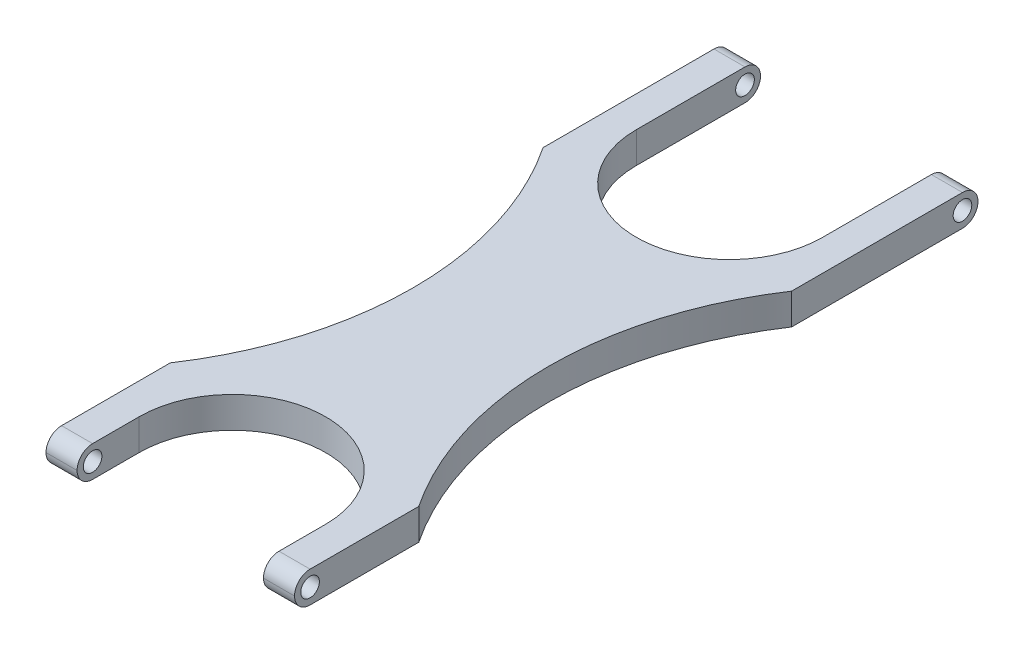
ISO-10303-21;
HEADER;
FILE_DESCRIPTION(('STEP AP214'),'2;1');
FILE_NAME('part.step','',(''),(''),'','','');
FILE_SCHEMA(('AUTOMOTIVE_DESIGN { 1 0 10303 214 1 1 1 1 }'));
ENDSEC;
DATA;
#1=APPLICATION_CONTEXT('core data for automotive mechanical design processes');
#2=APPLICATION_PROTOCOL_DEFINITION('international standard','automotive_design',2000,#1);
#3=PRODUCT_CONTEXT('',#1,'mechanical');
#4=PRODUCT('Part','Part','',(#3));
#5=PRODUCT_RELATED_PRODUCT_CATEGORY('part','',(#4));
#6=PRODUCT_DEFINITION_FORMATION('','',#4);
#7=PRODUCT_DEFINITION_CONTEXT('part definition',#1,'design');
#8=PRODUCT_DEFINITION('design','',#6,#7);
#9=PRODUCT_DEFINITION_SHAPE('','',#8);
#10=(LENGTH_UNIT() NAMED_UNIT(*) SI_UNIT(.MILLI.,.METRE.));
#11=(NAMED_UNIT(*) PLANE_ANGLE_UNIT() SI_UNIT($,.RADIAN.));
#12=(NAMED_UNIT(*) SI_UNIT($,.STERADIAN.) SOLID_ANGLE_UNIT());
#13=UNCERTAINTY_MEASURE_WITH_UNIT(LENGTH_MEASURE(1.E-05),#10,'distance_accuracy_value','');
#14=(GEOMETRIC_REPRESENTATION_CONTEXT(3) GLOBAL_UNCERTAINTY_ASSIGNED_CONTEXT((#13)) GLOBAL_UNIT_ASSIGNED_CONTEXT((#10,
#11,#12)) REPRESENTATION_CONTEXT('',''));
#15=CARTESIAN_POINT('',(0.,0.,0.));
#16=DIRECTION('',(0.,0.,1.));
#17=DIRECTION('',(1.,0.,0.));
#18=AXIS2_PLACEMENT_3D('',#15,#16,#17);
#19=CARTESIAN_POINT('',(0.,12.7,0.));
#20=DIRECTION('',(1.,0.,0.));
#21=DIRECTION('',(0.,0.,-1.));
#22=AXIS2_PLACEMENT_3D('',#19,#20,#21);
#23=PLANE('',#22);
#24=CARTESIAN_POINT('',(-1.11022302462516E-13,6.35,6.35000000000002));
#25=DIRECTION('',(1.,0.,0.));
#26=DIRECTION('',(0.,0.,-1.));
#27=AXIS2_PLACEMENT_3D('',#24,#25,#26);
#28=CIRCLE('',#27,3.81);
#29=CARTESIAN_POINT('',(-1.12410081243297E-13,6.35,2.54000000000002));
#30=VERTEX_POINT('',#29);
#31=EDGE_CURVE('E643',#30,#30,#28,.T.);
#32=ORIENTED_EDGE('',*,*,#31,.T.);
#33=EDGE_LOOP('',(#32));
#34=FACE_BOUND('',#33,.T.);
#35=CARTESIAN_POINT('',(0.,6.35,6.34999999999999));
#36=DIRECTION('',(1.,0.,0.));
#37=DIRECTION('',(0.,0.,-1.));
#38=AXIS2_PLACEMENT_3D('',#35,#36,#37);
#39=CIRCLE('',#38,6.35);
#40=CARTESIAN_POINT('',(0.,12.7,6.34999999999999));
#41=VERTEX_POINT('',#40);
#42=CARTESIAN_POINT('',(0.,6.35,0.));
#43=VERTEX_POINT('',#42);
#44=EDGE_CURVE('E221',#41,#43,#39,.F.);
#45=ORIENTED_EDGE('',*,*,#44,.T.);
#46=CARTESIAN_POINT('',(0.,6.35,6.35));
#47=DIRECTION('',(1.,0.,0.));
#48=DIRECTION('',(0.,0.,-1.));
#49=AXIS2_PLACEMENT_3D('',#46,#47,#48);
#50=CIRCLE('',#49,6.35);
#51=CARTESIAN_POINT('',(0.,0.,6.35));
#52=VERTEX_POINT('',#51);
#53=EDGE_CURVE('E223',#43,#52,#50,.F.);
#54=ORIENTED_EDGE('',*,*,#53,.T.);
#55=DIRECTION('',(0.,0.,1.));
#56=VECTOR('',#55,1.);
#57=CARTESIAN_POINT('',(0.,0.,0.));
#58=LINE('',#57,#56);
#59=CARTESIAN_POINT('',(0.,0.,76.2));
#60=VERTEX_POINT('',#59);
#61=EDGE_CURVE('E194',#52,#60,#58,.T.);
#62=ORIENTED_EDGE('',*,*,#61,.T.);
#63=DIRECTION('',(0.,-1.,0.));
#64=VECTOR('',#63,1.);
#65=CARTESIAN_POINT('',(0.,12.7,76.2));
#66=LINE('',#65,#64);
#67=CARTESIAN_POINT('',(0.,12.7,76.2));
#68=VERTEX_POINT('',#67);
#69=EDGE_CURVE('E187',#68,#60,#66,.T.);
#70=ORIENTED_EDGE('',*,*,#69,.F.);
#71=DIRECTION('',(0.,0.,1.));
#72=VECTOR('',#71,1.);
#73=CARTESIAN_POINT('',(0.,12.7,0.));
#74=LINE('',#73,#72);
#75=EDGE_CURVE('E169',#41,#68,#74,.T.);
#76=ORIENTED_EDGE('',*,*,#75,.F.);
#77=EDGE_LOOP('',(#45,#54,#62,#70,#76));
#78=FACE_BOUND('',#77,.T.);
#79=ADVANCED_FACE('F32',(#34,#78),#23,.F.);
#80=CARTESIAN_POINT('',(-114.3,12.7,152.4));
#81=DIRECTION('',(0.,-1.,0.));
#82=DIRECTION('',(0.,0.,-1.));
#83=AXIS2_PLACEMENT_3D('',#80,#81,#82);
#84=CYLINDRICAL_SURFACE('',#83,137.371503595178);
#85=CARTESIAN_POINT('',(-114.3,0.,152.4));
#86=DIRECTION('',(0.,-1.,0.));
#87=DIRECTION('',(0.,0.,-1.));
#88=AXIS2_PLACEMENT_3D('',#85,#86,#87);
#89=CIRCLE('',#88,137.371503595178);
#90=CARTESIAN_POINT('',(0.,0.,228.6));
#91=VERTEX_POINT('',#90);
#92=EDGE_CURVE('E293',#60,#91,#89,.T.);
#93=ORIENTED_EDGE('',*,*,#92,.T.);
#94=DIRECTION('',(0.,-1.,0.));
#95=VECTOR('',#94,1.);
#96=CARTESIAN_POINT('',(0.,12.7,228.6));
#97=LINE('',#96,#95);
#98=CARTESIAN_POINT('',(0.,12.7,228.6));
#99=VERTEX_POINT('',#98);
#100=EDGE_CURVE('E189',#99,#91,#97,.T.);
#101=ORIENTED_EDGE('',*,*,#100,.F.);
#102=CARTESIAN_POINT('',(-114.3,12.7,152.4));
#103=DIRECTION('',(0.,-1.,0.));
#104=DIRECTION('',(0.,0.,-1.));
#105=AXIS2_PLACEMENT_3D('',#102,#103,#104);
#106=CIRCLE('',#105,137.371503595178);
#107=EDGE_CURVE('E174',#68,#99,#106,.T.);
#108=ORIENTED_EDGE('',*,*,#107,.F.);
#109=ORIENTED_EDGE('',*,*,#69,.T.);
#110=EDGE_LOOP('',(#93,#101,#108,#109));
#111=FACE_BOUND('',#110,.T.);
#112=ADVANCED_FACE('F186',(#111),#84,.F.);
#113=CARTESIAN_POINT('',(0.,12.7,228.6));
#114=DIRECTION('',(1.,0.,0.));
#115=DIRECTION('',(0.,0.,-1.));
#116=AXIS2_PLACEMENT_3D('',#113,#114,#115);
#117=PLANE('',#116);
#118=CARTESIAN_POINT('',(0.,6.35,273.05));
#119=DIRECTION('',(1.,0.,0.));
#120=DIRECTION('',(0.,0.,-1.));
#121=AXIS2_PLACEMENT_3D('',#118,#119,#120);
#122=CIRCLE('',#121,3.81000000000004);
#123=CARTESIAN_POINT('',(0.,6.35,269.24));
#124=VERTEX_POINT('',#123);
#125=EDGE_CURVE('E267',#124,#124,#122,.T.);
#126=ORIENTED_EDGE('',*,*,#125,.T.);
#127=EDGE_LOOP('',(#126));
#128=FACE_BOUND('',#127,.T.);
#129=DIRECTION('',(0.,0.,1.));
#130=VECTOR('',#129,1.);
#131=CARTESIAN_POINT('',(0.,0.,228.6));
#132=LINE('',#131,#130);
#133=CARTESIAN_POINT('',(0.,0.,273.05));
#134=VERTEX_POINT('',#133);
#135=EDGE_CURVE('E295',#91,#134,#132,.T.);
#136=ORIENTED_EDGE('',*,*,#135,.T.);
#137=CARTESIAN_POINT('',(0.,6.35,273.05));
#138=DIRECTION('',(1.,0.,0.));
#139=DIRECTION('',(0.,0.,-1.));
#140=AXIS2_PLACEMENT_3D('',#137,#138,#139);
#141=CIRCLE('',#140,6.35);
#142=CARTESIAN_POINT('',(0.,6.35,279.4));
#143=VERTEX_POINT('',#142);
#144=EDGE_CURVE('E242',#134,#143,#141,.F.);
#145=ORIENTED_EDGE('',*,*,#144,.T.);
#146=CARTESIAN_POINT('',(0.,6.35,273.05));
#147=DIRECTION('',(1.,0.,0.));
#148=DIRECTION('',(0.,0.,-1.));
#149=AXIS2_PLACEMENT_3D('',#146,#147,#148);
#150=CIRCLE('',#149,6.35);
#151=CARTESIAN_POINT('',(0.,12.7,273.05));
#152=VERTEX_POINT('',#151);
#153=EDGE_CURVE('E240',#143,#152,#150,.F.);
#154=ORIENTED_EDGE('',*,*,#153,.T.);
#155=DIRECTION('',(0.,0.,1.));
#156=VECTOR('',#155,1.);
#157=CARTESIAN_POINT('',(0.,12.7,228.6));
#158=LINE('',#157,#156);
#159=EDGE_CURVE('E191',#99,#152,#158,.T.);
#160=ORIENTED_EDGE('',*,*,#159,.F.);
#161=ORIENTED_EDGE('',*,*,#100,.T.);
#162=EDGE_LOOP('',(#136,#145,#154,#160,#161));
#163=FACE_BOUND('',#162,.T.);
#164=ADVANCED_FACE('F396',(#128,#163),#117,.F.);
#165=CARTESIAN_POINT('',(12.7,12.7,279.4));
#166=DIRECTION('',(-1.,0.,0.));
#167=DIRECTION('',(0.,0.,1.));
#168=AXIS2_PLACEMENT_3D('',#165,#166,#167);
#169=PLANE('',#168);
#170=CARTESIAN_POINT('',(12.7,6.35,273.05));
#171=DIRECTION('',(-1.,0.,0.));
#172=DIRECTION('',(0.,0.,1.));
#173=AXIS2_PLACEMENT_3D('',#170,#171,#172);
#174=CIRCLE('',#173,3.81000000000004);
#175=CARTESIAN_POINT('',(12.7,6.35,276.86));
#176=VERTEX_POINT('',#175);
#177=EDGE_CURVE('E258',#176,#176,#174,.T.);
#178=ORIENTED_EDGE('',*,*,#177,.T.);
#179=EDGE_LOOP('',(#178));
#180=FACE_BOUND('',#179,.T.);
#181=CARTESIAN_POINT('',(12.7,6.35,273.05));
#182=DIRECTION('',(-1.,0.,0.));
#183=DIRECTION('',(0.,0.,1.));
#184=AXIS2_PLACEMENT_3D('',#181,#182,#183);
#185=CIRCLE('',#184,6.35);
#186=CARTESIAN_POINT('',(12.7,12.7,273.05));
#187=VERTEX_POINT('',#186);
#188=CARTESIAN_POINT('',(12.7,6.35,279.4));
#189=VERTEX_POINT('',#188);
#190=EDGE_CURVE('E236',#187,#189,#185,.F.);
#191=ORIENTED_EDGE('',*,*,#190,.T.);
#192=CARTESIAN_POINT('',(12.7,6.35,273.05));
#193=DIRECTION('',(-1.,0.,0.));
#194=DIRECTION('',(0.,0.,1.));
#195=AXIS2_PLACEMENT_3D('',#192,#193,#194);
#196=CIRCLE('',#195,6.35);
#197=CARTESIAN_POINT('',(12.7,0.,273.05));
#198=VERTEX_POINT('',#197);
#199=EDGE_CURVE('E238',#189,#198,#196,.F.);
#200=ORIENTED_EDGE('',*,*,#199,.T.);
#201=DIRECTION('',(0.,0.,-1.));
#202=VECTOR('',#201,1.);
#203=CARTESIAN_POINT('',(12.7,0.,279.4));
#204=LINE('',#203,#202);
#205=CARTESIAN_POINT('',(12.7,0.,254.));
#206=VERTEX_POINT('',#205);
#207=EDGE_CURVE('E298',#198,#206,#204,.T.);
#208=ORIENTED_EDGE('',*,*,#207,.T.);
#209=DIRECTION('',(0.,-1.,0.));
#210=VECTOR('',#209,1.);
#211=CARTESIAN_POINT('',(12.7,12.7,254.));
#212=LINE('',#211,#210);
#213=CARTESIAN_POINT('',(12.7,12.7,254.));
#214=VERTEX_POINT('',#213);
#215=EDGE_CURVE('E200',#214,#206,#212,.T.);
#216=ORIENTED_EDGE('',*,*,#215,.F.);
#217=DIRECTION('',(0.,0.,-1.));
#218=VECTOR('',#217,1.);
#219=CARTESIAN_POINT('',(12.7,12.7,279.4));
#220=LINE('',#219,#218);
#221=EDGE_CURVE('E272',#187,#214,#220,.T.);
#222=ORIENTED_EDGE('',*,*,#221,.F.);
#223=EDGE_LOOP('',(#191,#200,#208,#216,#222));
#224=FACE_BOUND('',#223,.T.);
#225=ADVANCED_FACE('F339',(#180,#224),#169,.F.);
#226=CARTESIAN_POINT('',(50.8,12.7,254.));
#227=DIRECTION('',(0.,-1.,0.));
#228=DIRECTION('',(0.,0.,-1.));
#229=AXIS2_PLACEMENT_3D('',#226,#227,#228);
#230=CYLINDRICAL_SURFACE('',#229,38.1);
#231=CARTESIAN_POINT('',(50.8,0.,254.));
#232=DIRECTION('',(0.,-1.,0.));
#233=DIRECTION('',(0.,0.,1.));
#234=AXIS2_PLACEMENT_3D('',#231,#232,#233);
#235=CIRCLE('',#234,38.1);
#236=CARTESIAN_POINT('',(88.9,0.,254.));
#237=VERTEX_POINT('',#236);
#238=EDGE_CURVE('E300',#206,#237,#235,.T.);
#239=ORIENTED_EDGE('',*,*,#238,.T.);
#240=DIRECTION('',(0.,-1.,0.));
#241=VECTOR('',#240,1.);
#242=CARTESIAN_POINT('',(88.9,12.7,254.));
#243=LINE('',#242,#241);
#244=CARTESIAN_POINT('',(88.9,12.7,254.));
#245=VERTEX_POINT('',#244);
#246=EDGE_CURVE('E328',#245,#237,#243,.T.);
#247=ORIENTED_EDGE('',*,*,#246,.F.);
#248=CARTESIAN_POINT('',(50.8,12.7,254.));
#249=DIRECTION('',(0.,-1.,0.));
#250=DIRECTION('',(0.,0.,-1.));
#251=AXIS2_PLACEMENT_3D('',#248,#249,#250);
#252=CIRCLE('',#251,38.1);
#253=EDGE_CURVE('E274',#214,#245,#252,.T.);
#254=ORIENTED_EDGE('',*,*,#253,.F.);
#255=ORIENTED_EDGE('',*,*,#215,.T.);
#256=EDGE_LOOP('',(#239,#247,#254,#255));
#257=FACE_BOUND('',#256,.T.);
#258=ADVANCED_FACE('F334',(#257),#230,.F.);
#259=CARTESIAN_POINT('',(88.9,12.7,279.4));
#260=DIRECTION('',(1.,0.,0.));
#261=DIRECTION('',(0.,0.,-1.));
#262=AXIS2_PLACEMENT_3D('',#259,#260,#261);
#263=PLANE('',#262);
#264=CARTESIAN_POINT('',(88.9,6.35,273.05));
#265=DIRECTION('',(1.,0.,0.));
#266=DIRECTION('',(0.,0.,-1.));
#267=AXIS2_PLACEMENT_3D('',#264,#265,#266);
#268=CIRCLE('',#267,3.81000000000004);
#269=CARTESIAN_POINT('',(88.9,6.35,269.24));
#270=VERTEX_POINT('',#269);
#271=EDGE_CURVE('E262',#270,#270,#268,.T.);
#272=ORIENTED_EDGE('',*,*,#271,.T.);
#273=EDGE_LOOP('',(#272));
#274=FACE_BOUND('',#273,.T.);
#275=DIRECTION('',(0.,0.,1.));
#276=VECTOR('',#275,1.);
#277=CARTESIAN_POINT('',(88.9,0.,279.4));
#278=LINE('',#277,#276);
#279=CARTESIAN_POINT('',(88.9,0.,273.05));
#280=VERTEX_POINT('',#279);
#281=EDGE_CURVE('E302',#237,#280,#278,.T.);
#282=ORIENTED_EDGE('',*,*,#281,.T.);
#283=CARTESIAN_POINT('',(88.9,6.35,273.05));
#284=DIRECTION('',(1.,0.,0.));
#285=DIRECTION('',(0.,0.,-1.));
#286=AXIS2_PLACEMENT_3D('',#283,#284,#285);
#287=CIRCLE('',#286,6.35);
#288=CARTESIAN_POINT('',(88.9,6.35,279.4));
#289=VERTEX_POINT('',#288);
#290=EDGE_CURVE('E11',#280,#289,#287,.F.);
#291=ORIENTED_EDGE('',*,*,#290,.T.);
#292=CARTESIAN_POINT('',(88.9,6.35,273.05));
#293=DIRECTION('',(1.,0.,0.));
#294=DIRECTION('',(0.,0.,-1.));
#295=AXIS2_PLACEMENT_3D('',#292,#293,#294);
#296=CIRCLE('',#295,6.35);
#297=CARTESIAN_POINT('',(88.9,12.7,273.05));
#298=VERTEX_POINT('',#297);
#299=EDGE_CURVE('E41',#289,#298,#296,.F.);
#300=ORIENTED_EDGE('',*,*,#299,.T.);
#301=DIRECTION('',(0.,0.,1.));
#302=VECTOR('',#301,1.);
#303=CARTESIAN_POINT('',(88.9,12.7,279.4));
#304=LINE('',#303,#302);
#305=EDGE_CURVE('E276',#245,#298,#304,.T.);
#306=ORIENTED_EDGE('',*,*,#305,.F.);
#307=ORIENTED_EDGE('',*,*,#246,.T.);
#308=EDGE_LOOP('',(#282,#291,#300,#306,#307));
#309=FACE_BOUND('',#308,.T.);
#310=ADVANCED_FACE('F350',(#274,#309),#263,.F.);
#311=CARTESIAN_POINT('',(101.6,12.7,228.6));
#312=DIRECTION('',(-1.,0.,0.));
#313=DIRECTION('',(0.,0.,1.));
#314=AXIS2_PLACEMENT_3D('',#311,#312,#313);
#315=PLANE('',#314);
#316=CARTESIAN_POINT('',(101.6,6.35,273.05));
#317=DIRECTION('',(1.,0.,0.));
#318=DIRECTION('',(0.,0.,-1.));
#319=AXIS2_PLACEMENT_3D('',#316,#317,#318);
#320=CIRCLE('',#319,3.81000000000004);
#321=CARTESIAN_POINT('',(101.6,6.35,269.24));
#322=VERTEX_POINT('',#321);
#323=EDGE_CURVE('E639',#322,#322,#320,.T.);
#324=ORIENTED_EDGE('',*,*,#323,.F.);
#325=EDGE_LOOP('',(#324));
#326=FACE_BOUND('',#325,.T.);
#327=CARTESIAN_POINT('',(101.6,6.35,273.05));
#328=DIRECTION('',(-1.,0.,0.));
#329=DIRECTION('',(0.,0.,1.));
#330=AXIS2_PLACEMENT_3D('',#327,#328,#329);
#331=CIRCLE('',#330,6.35);
#332=CARTESIAN_POINT('',(101.6,12.7,273.05));
#333=VERTEX_POINT('',#332);
#334=CARTESIAN_POINT('',(101.6,6.35,279.4));
#335=VERTEX_POINT('',#334);
#336=EDGE_CURVE('E55',#333,#335,#331,.F.);
#337=ORIENTED_EDGE('',*,*,#336,.T.);
#338=CARTESIAN_POINT('',(101.6,6.35,273.05));
#339=DIRECTION('',(-1.,0.,0.));
#340=DIRECTION('',(0.,0.,1.));
#341=AXIS2_PLACEMENT_3D('',#338,#339,#340);
#342=CIRCLE('',#341,6.35);
#343=CARTESIAN_POINT('',(101.6,0.,273.05));
#344=VERTEX_POINT('',#343);
#345=EDGE_CURVE('E245',#335,#344,#342,.F.);
#346=ORIENTED_EDGE('',*,*,#345,.T.);
#347=DIRECTION('',(0.,0.,-1.));
#348=VECTOR('',#347,1.);
#349=CARTESIAN_POINT('',(101.6,0.,228.6));
#350=LINE('',#349,#348);
#351=CARTESIAN_POINT('',(101.6,0.,228.6));
#352=VERTEX_POINT('',#351);
#353=EDGE_CURVE('E304',#344,#352,#350,.T.);
#354=ORIENTED_EDGE('',*,*,#353,.T.);
#355=DIRECTION('',(0.,-1.,0.));
#356=VECTOR('',#355,1.);
#357=CARTESIAN_POINT('',(101.6,12.7,228.6));
#358=LINE('',#357,#356);
#359=CARTESIAN_POINT('',(101.6,12.7,228.6));
#360=VERTEX_POINT('',#359);
#361=EDGE_CURVE('E325',#360,#352,#358,.T.);
#362=ORIENTED_EDGE('',*,*,#361,.F.);
#363=DIRECTION('',(0.,0.,-1.));
#364=VECTOR('',#363,1.);
#365=CARTESIAN_POINT('',(101.6,12.7,228.6));
#366=LINE('',#365,#364);
#367=EDGE_CURVE('E279',#333,#360,#366,.T.);
#368=ORIENTED_EDGE('',*,*,#367,.F.);
#369=EDGE_LOOP('',(#337,#346,#354,#362,#368));
#370=FACE_BOUND('',#369,.T.);
#371=ADVANCED_FACE('F355',(#326,#370),#315,.F.);
#372=CARTESIAN_POINT('',(215.9,12.7,152.4));
#373=DIRECTION('',(0.,-1.,0.));
#374=DIRECTION('',(0.,0.,-1.));
#375=AXIS2_PLACEMENT_3D('',#372,#373,#374);
#376=CYLINDRICAL_SURFACE('',#375,137.371503595178);
#377=CARTESIAN_POINT('',(215.9,0.,152.4));
#378=DIRECTION('',(0.,-1.,0.));
#379=DIRECTION('',(0.,0.,1.));
#380=AXIS2_PLACEMENT_3D('',#377,#378,#379);
#381=CIRCLE('',#380,137.371503595178);
#382=CARTESIAN_POINT('',(101.6,0.,76.2));
#383=VERTEX_POINT('',#382);
#384=EDGE_CURVE('E306',#352,#383,#381,.T.);
#385=ORIENTED_EDGE('',*,*,#384,.T.);
#386=DIRECTION('',(0.,-1.,0.));
#387=VECTOR('',#386,1.);
#388=CARTESIAN_POINT('',(101.6,12.7,76.2));
#389=LINE('',#388,#387);
#390=CARTESIAN_POINT('',(101.6,12.7,76.2));
#391=VERTEX_POINT('',#390);
#392=EDGE_CURVE('E322',#391,#383,#389,.T.);
#393=ORIENTED_EDGE('',*,*,#392,.F.);
#394=CARTESIAN_POINT('',(215.9,12.7,152.4));
#395=DIRECTION('',(0.,-1.,0.));
#396=DIRECTION('',(0.,0.,1.));
#397=AXIS2_PLACEMENT_3D('',#394,#395,#396);
#398=CIRCLE('',#397,137.371503595178);
#399=EDGE_CURVE('E281',#360,#391,#398,.T.);
#400=ORIENTED_EDGE('',*,*,#399,.F.);
#401=ORIENTED_EDGE('',*,*,#361,.T.);
#402=EDGE_LOOP('',(#385,#393,#400,#401));
#403=FACE_BOUND('',#402,.T.);
#404=ADVANCED_FACE('F361',(#403),#376,.F.);
#405=CARTESIAN_POINT('',(101.6,12.7,0.));
#406=DIRECTION('',(-1.,0.,0.));
#407=DIRECTION('',(0.,0.,1.));
#408=AXIS2_PLACEMENT_3D('',#405,#406,#407);
#409=PLANE('',#408);
#410=CARTESIAN_POINT('',(101.6,6.35,6.34999999999999));
#411=DIRECTION('',(1.,0.,0.));
#412=DIRECTION('',(0.,0.,-1.));
#413=AXIS2_PLACEMENT_3D('',#410,#411,#412);
#414=CIRCLE('',#413,3.81);
#415=CARTESIAN_POINT('',(101.6,6.35,2.53999999999999));
#416=VERTEX_POINT('',#415);
#417=EDGE_CURVE('E635',#416,#416,#414,.T.);
#418=ORIENTED_EDGE('',*,*,#417,.F.);
#419=EDGE_LOOP('',(#418));
#420=FACE_BOUND('',#419,.T.);
#421=DIRECTION('',(0.,0.,-1.));
#422=VECTOR('',#421,1.);
#423=CARTESIAN_POINT('',(101.6,0.,0.));
#424=LINE('',#423,#422);
#425=CARTESIAN_POINT('',(101.6,0.,6.34999999999999));
#426=VERTEX_POINT('',#425);
#427=EDGE_CURVE('E308',#383,#426,#424,.T.);
#428=ORIENTED_EDGE('',*,*,#427,.T.);
#429=CARTESIAN_POINT('',(101.6,6.35,6.34999999999999));
#430=DIRECTION('',(-1.,0.,0.));
#431=DIRECTION('',(0.,0.,1.));
#432=AXIS2_PLACEMENT_3D('',#429,#430,#431);
#433=CIRCLE('',#432,6.35);
#434=CARTESIAN_POINT('',(101.6,6.35,0.));
#435=VERTEX_POINT('',#434);
#436=EDGE_CURVE('E219',#426,#435,#433,.F.);
#437=ORIENTED_EDGE('',*,*,#436,.T.);
#438=CARTESIAN_POINT('',(101.6,6.35,6.34999999999999));
#439=DIRECTION('',(-1.,0.,0.));
#440=DIRECTION('',(0.,0.,1.));
#441=AXIS2_PLACEMENT_3D('',#438,#439,#440);
#442=CIRCLE('',#441,6.35);
#443=CARTESIAN_POINT('',(101.6,12.7,6.34999999999999));
#444=VERTEX_POINT('',#443);
#445=EDGE_CURVE('E217',#435,#444,#442,.F.);
#446=ORIENTED_EDGE('',*,*,#445,.T.);
#447=DIRECTION('',(0.,0.,-1.));
#448=VECTOR('',#447,1.);
#449=CARTESIAN_POINT('',(101.6,12.7,0.));
#450=LINE('',#449,#448);
#451=EDGE_CURVE('E283',#391,#444,#450,.T.);
#452=ORIENTED_EDGE('',*,*,#451,.F.);
#453=ORIENTED_EDGE('',*,*,#392,.T.);
#454=EDGE_LOOP('',(#428,#437,#446,#452,#453));
#455=FACE_BOUND('',#454,.T.);
#456=ADVANCED_FACE('F365',(#420,#455),#409,.F.);
#457=CARTESIAN_POINT('',(88.9,12.7,0.));
#458=DIRECTION('',(1.,0.,0.));
#459=DIRECTION('',(0.,0.,-1.));
#460=AXIS2_PLACEMENT_3D('',#457,#458,#459);
#461=PLANE('',#460);
#462=CARTESIAN_POINT('',(88.9,6.35,6.34999999999999));
#463=DIRECTION('',(1.,0.,0.));
#464=DIRECTION('',(0.,0.,-1.));
#465=AXIS2_PLACEMENT_3D('',#462,#463,#464);
#466=CIRCLE('',#465,3.81);
#467=CARTESIAN_POINT('',(88.9,6.35,2.53999999999999));
#468=VERTEX_POINT('',#467);
#469=EDGE_CURVE('E638',#468,#468,#466,.T.);
#470=ORIENTED_EDGE('',*,*,#469,.T.);
#471=EDGE_LOOP('',(#470));
#472=FACE_BOUND('',#471,.T.);
#473=CARTESIAN_POINT('',(88.9,6.35,6.34999999999999));
#474=DIRECTION('',(1.,0.,0.));
#475=DIRECTION('',(0.,0.,-1.));
#476=AXIS2_PLACEMENT_3D('',#473,#474,#475);
#477=CIRCLE('',#476,6.35);
#478=CARTESIAN_POINT('',(88.9,12.7,6.34999999999999));
#479=VERTEX_POINT('',#478);
#480=CARTESIAN_POINT('',(88.9,6.35,0.));
#481=VERTEX_POINT('',#480);
#482=EDGE_CURVE('E196',#479,#481,#477,.F.);
#483=ORIENTED_EDGE('',*,*,#482,.T.);
#484=CARTESIAN_POINT('',(88.9,6.35,6.34999999999999));
#485=DIRECTION('',(1.,0.,0.));
#486=DIRECTION('',(0.,0.,-1.));
#487=AXIS2_PLACEMENT_3D('',#484,#485,#486);
#488=CIRCLE('',#487,6.35);
#489=CARTESIAN_POINT('',(88.9,0.,6.34999999999999));
#490=VERTEX_POINT('',#489);
#491=EDGE_CURVE('E198',#481,#490,#488,.F.);
#492=ORIENTED_EDGE('',*,*,#491,.T.);
#493=DIRECTION('',(0.,0.,1.));
#494=VECTOR('',#493,1.);
#495=CARTESIAN_POINT('',(88.9,0.,0.));
#496=LINE('',#495,#494);
#497=CARTESIAN_POINT('',(88.9,0.,50.8));
#498=VERTEX_POINT('',#497);
#499=EDGE_CURVE('E311',#490,#498,#496,.T.);
#500=ORIENTED_EDGE('',*,*,#499,.T.);
#501=DIRECTION('',(0.,-1.,0.));
#502=VECTOR('',#501,1.);
#503=CARTESIAN_POINT('',(88.9,12.7,50.8));
#504=LINE('',#503,#502);
#505=CARTESIAN_POINT('',(88.9,12.7,50.8));
#506=VERTEX_POINT('',#505);
#507=EDGE_CURVE('E319',#506,#498,#504,.T.);
#508=ORIENTED_EDGE('',*,*,#507,.F.);
#509=DIRECTION('',(0.,0.,1.));
#510=VECTOR('',#509,1.);
#511=CARTESIAN_POINT('',(88.9,12.7,0.));
#512=LINE('',#511,#510);
#513=EDGE_CURVE('E285',#479,#506,#512,.T.);
#514=ORIENTED_EDGE('',*,*,#513,.F.);
#515=EDGE_LOOP('',(#483,#492,#500,#508,#514));
#516=FACE_BOUND('',#515,.T.);
#517=ADVANCED_FACE('F375',(#472,#516),#461,.F.);
#518=CARTESIAN_POINT('',(50.8,12.7,50.8));
#519=DIRECTION('',(0.,-1.,0.));
#520=DIRECTION('',(0.,0.,-1.));
#521=AXIS2_PLACEMENT_3D('',#518,#519,#520);
#522=CYLINDRICAL_SURFACE('',#521,38.1);
#523=CARTESIAN_POINT('',(50.8,0.,50.8));
#524=DIRECTION('',(0.,-1.,0.));
#525=DIRECTION('',(0.,0.,1.));
#526=AXIS2_PLACEMENT_3D('',#523,#524,#525);
#527=CIRCLE('',#526,38.1);
#528=CARTESIAN_POINT('',(12.7,0.,50.8));
#529=VERTEX_POINT('',#528);
#530=EDGE_CURVE('E313',#498,#529,#527,.T.);
#531=ORIENTED_EDGE('',*,*,#530,.T.);
#532=DIRECTION('',(0.,-1.,0.));
#533=VECTOR('',#532,1.);
#534=CARTESIAN_POINT('',(12.7,12.7,50.8));
#535=LINE('',#534,#533);
#536=CARTESIAN_POINT('',(12.7,12.7,50.8));
#537=VERTEX_POINT('',#536);
#538=EDGE_CURVE('E291',#537,#529,#535,.T.);
#539=ORIENTED_EDGE('',*,*,#538,.F.);
#540=CARTESIAN_POINT('',(50.8,12.7,50.8));
#541=DIRECTION('',(0.,-1.,0.));
#542=DIRECTION('',(0.,0.,-1.));
#543=AXIS2_PLACEMENT_3D('',#540,#541,#542);
#544=CIRCLE('',#543,38.1);
#545=EDGE_CURVE('E287',#506,#537,#544,.T.);
#546=ORIENTED_EDGE('',*,*,#545,.F.);
#547=ORIENTED_EDGE('',*,*,#507,.T.);
#548=EDGE_LOOP('',(#531,#539,#546,#547));
#549=FACE_BOUND('',#548,.T.);
#550=ADVANCED_FACE('F381',(#549),#522,.F.);
#551=CARTESIAN_POINT('',(12.7,12.7,0.));
#552=DIRECTION('',(-1.,0.,0.));
#553=DIRECTION('',(0.,0.,1.));
#554=AXIS2_PLACEMENT_3D('',#551,#552,#553);
#555=PLANE('',#554);
#556=CARTESIAN_POINT('',(12.7,6.35,6.35000000000002));
#557=DIRECTION('',(-1.,0.,0.));
#558=DIRECTION('',(0.,0.,1.));
#559=AXIS2_PLACEMENT_3D('',#556,#557,#558);
#560=CIRCLE('',#559,3.81);
#561=CARTESIAN_POINT('',(12.7,6.35,10.16));
#562=VERTEX_POINT('',#561);
#563=EDGE_CURVE('E36',#562,#562,#560,.T.);
#564=ORIENTED_EDGE('',*,*,#563,.T.);
#565=EDGE_LOOP('',(#564));
#566=FACE_BOUND('',#565,.T.);
#567=DIRECTION('',(0.,0.,-1.));
#568=VECTOR('',#567,1.);
#569=CARTESIAN_POINT('',(12.7,0.,0.));
#570=LINE('',#569,#568);
#571=CARTESIAN_POINT('',(12.7,0.,6.35));
#572=VERTEX_POINT('',#571);
#573=EDGE_CURVE('E182',#529,#572,#570,.T.);
#574=ORIENTED_EDGE('',*,*,#573,.T.);
#575=CARTESIAN_POINT('',(12.7,6.35,6.35));
#576=DIRECTION('',(-1.,0.,0.));
#577=DIRECTION('',(0.,0.,1.));
#578=AXIS2_PLACEMENT_3D('',#575,#576,#577);
#579=CIRCLE('',#578,6.35);
#580=CARTESIAN_POINT('',(12.7,6.35,0.));
#581=VERTEX_POINT('',#580);
#582=EDGE_CURVE('E227',#572,#581,#579,.F.);
#583=ORIENTED_EDGE('',*,*,#582,.T.);
#584=CARTESIAN_POINT('',(12.7,6.35,6.34999999999999));
#585=DIRECTION('',(-1.,0.,0.));
#586=DIRECTION('',(0.,0.,1.));
#587=AXIS2_PLACEMENT_3D('',#584,#585,#586);
#588=CIRCLE('',#587,6.35);
#589=CARTESIAN_POINT('',(12.7,12.7,6.34999999999999));
#590=VERTEX_POINT('',#589);
#591=EDGE_CURVE('E225',#581,#590,#588,.F.);
#592=ORIENTED_EDGE('',*,*,#591,.T.);
#593=DIRECTION('',(0.,0.,-1.));
#594=VECTOR('',#593,1.);
#595=CARTESIAN_POINT('',(12.7,12.7,0.));
#596=LINE('',#595,#594);
#597=EDGE_CURVE('E289',#537,#590,#596,.T.);
#598=ORIENTED_EDGE('',*,*,#597,.F.);
#599=ORIENTED_EDGE('',*,*,#538,.T.);
#600=EDGE_LOOP('',(#574,#583,#592,#598,#599));
#601=FACE_BOUND('',#600,.T.);
#602=ADVANCED_FACE('F385',(#566,#601),#555,.F.);
#603=CARTESIAN_POINT('',(-114.3,12.7,152.4));
#604=DIRECTION('',(0.,-1.,0.));
#605=DIRECTION('',(0.,0.,-1.));
#606=AXIS2_PLACEMENT_3D('',#603,#604,#605);
#607=PLANE('',#606);
#608=ORIENTED_EDGE('',*,*,#451,.T.);
#609=DIRECTION('',(-1.,0.,0.));
#610=VECTOR('',#609,1.);
#611=CARTESIAN_POINT('',(-114.3,12.7,6.35000000000005));
#612=LINE('',#611,#610);
#613=EDGE_CURVE('E234',#444,#479,#612,.T.);
#614=ORIENTED_EDGE('',*,*,#613,.T.);
#615=ORIENTED_EDGE('',*,*,#513,.T.);
#616=ORIENTED_EDGE('',*,*,#545,.T.);
#617=ORIENTED_EDGE('',*,*,#597,.T.);
#618=DIRECTION('',(-1.,0.,0.));
#619=VECTOR('',#618,1.);
#620=CARTESIAN_POINT('',(-114.3,12.7,6.34999999999999));
#621=LINE('',#620,#619);
#622=EDGE_CURVE('E178',#590,#41,#621,.T.);
#623=ORIENTED_EDGE('',*,*,#622,.T.);
#624=ORIENTED_EDGE('',*,*,#75,.T.);
#625=ORIENTED_EDGE('',*,*,#107,.T.);
#626=ORIENTED_EDGE('',*,*,#159,.T.);
#627=DIRECTION('',(1.,0.,0.));
#628=VECTOR('',#627,1.);
#629=CARTESIAN_POINT('',(-114.3,12.7,273.05));
#630=LINE('',#629,#628);
#631=EDGE_CURVE('E231',#152,#187,#630,.T.);
#632=ORIENTED_EDGE('',*,*,#631,.T.);
#633=ORIENTED_EDGE('',*,*,#221,.T.);
#634=ORIENTED_EDGE('',*,*,#253,.T.);
#635=ORIENTED_EDGE('',*,*,#305,.T.);
#636=DIRECTION('',(1.,0.,0.));
#637=VECTOR('',#636,1.);
#638=CARTESIAN_POINT('',(-114.3,12.7,273.05));
#639=LINE('',#638,#637);
#640=EDGE_CURVE('E229',#298,#333,#639,.T.);
#641=ORIENTED_EDGE('',*,*,#640,.T.);
#642=ORIENTED_EDGE('',*,*,#367,.T.);
#643=ORIENTED_EDGE('',*,*,#399,.T.);
#644=EDGE_LOOP('',(#608,#614,#615,#616,#617,#623,#624,#625,#626,#632,#633,#634,#635,#641,#642,#643));
#645=FACE_BOUND('',#644,.T.);
#646=ADVANCED_FACE('F172',(#645),#607,.F.);
#647=CARTESIAN_POINT('',(-114.3,0.,152.4));
#648=DIRECTION('',(0.,-1.,0.));
#649=DIRECTION('',(0.,0.,-1.));
#650=AXIS2_PLACEMENT_3D('',#647,#648,#649);
#651=PLANE('',#650);
#652=ORIENTED_EDGE('',*,*,#499,.F.);
#653=DIRECTION('',(-1.,0.,0.));
#654=VECTOR('',#653,1.);
#655=CARTESIAN_POINT('',(101.6,0.,6.34999999999999));
#656=LINE('',#655,#654);
#657=EDGE_CURVE('E214',#490,#426,#656,.F.);
#658=ORIENTED_EDGE('',*,*,#657,.T.);
#659=ORIENTED_EDGE('',*,*,#427,.F.);
#660=ORIENTED_EDGE('',*,*,#384,.F.);
#661=ORIENTED_EDGE('',*,*,#353,.F.);
#662=DIRECTION('',(1.,0.,0.));
#663=VECTOR('',#662,1.);
#664=CARTESIAN_POINT('',(88.9,0.,273.05));
#665=LINE('',#664,#663);
#666=EDGE_CURVE('E205',#344,#280,#665,.F.);
#667=ORIENTED_EDGE('',*,*,#666,.T.);
#668=ORIENTED_EDGE('',*,*,#281,.F.);
#669=ORIENTED_EDGE('',*,*,#238,.F.);
#670=ORIENTED_EDGE('',*,*,#207,.F.);
#671=DIRECTION('',(1.,0.,0.));
#672=VECTOR('',#671,1.);
#673=CARTESIAN_POINT('',(0.,0.,273.05));
#674=LINE('',#673,#672);
#675=EDGE_CURVE('E208',#198,#134,#674,.F.);
#676=ORIENTED_EDGE('',*,*,#675,.T.);
#677=ORIENTED_EDGE('',*,*,#135,.F.);
#678=ORIENTED_EDGE('',*,*,#92,.F.);
#679=ORIENTED_EDGE('',*,*,#61,.F.);
#680=DIRECTION('',(-1.,0.,0.));
#681=VECTOR('',#680,1.);
#682=CARTESIAN_POINT('',(12.7,0.,6.35));
#683=LINE('',#682,#681);
#684=EDGE_CURVE('E211',#52,#572,#683,.F.);
#685=ORIENTED_EDGE('',*,*,#684,.T.);
#686=ORIENTED_EDGE('',*,*,#573,.F.);
#687=ORIENTED_EDGE('',*,*,#530,.F.);
#688=EDGE_LOOP('',(#652,#658,#659,#660,#661,#667,#668,#669,#670,#676,#677,#678,#679,#685,#686,#687));
#689=FACE_BOUND('',#688,.T.);
#690=ADVANCED_FACE('F347',(#689),#651,.T.);
#691=CARTESIAN_POINT('',(-114.3,6.35,6.35000000000005));
#692=DIRECTION('',(-1.,0.,0.));
#693=DIRECTION('',(0.,0.,1.));
#694=AXIS2_PLACEMENT_3D('',#691,#692,#693);
#695=CYLINDRICAL_SURFACE('',#694,6.35);
#696=ORIENTED_EDGE('',*,*,#613,.F.);
#697=ORIENTED_EDGE('',*,*,#445,.F.);
#698=DIRECTION('',(-1.,0.,0.));
#699=VECTOR('',#698,1.);
#700=CARTESIAN_POINT('',(101.6,6.35,0.));
#701=LINE('',#700,#699);
#702=EDGE_CURVE('E248',#481,#435,#701,.F.);
#703=ORIENTED_EDGE('',*,*,#702,.F.);
#704=ORIENTED_EDGE('',*,*,#482,.F.);
#705=EDGE_LOOP('',(#696,#697,#703,#704));
#706=FACE_BOUND('',#705,.T.);
#707=ADVANCED_FACE('F371',(#706),#695,.T.);
#708=CARTESIAN_POINT('',(101.6,6.35,6.34999999999999));
#709=DIRECTION('',(1.,0.,0.));
#710=DIRECTION('',(0.,0.,-1.));
#711=AXIS2_PLACEMENT_3D('',#708,#709,#710);
#712=CYLINDRICAL_SURFACE('',#711,6.35);
#713=ORIENTED_EDGE('',*,*,#436,.F.);
#714=ORIENTED_EDGE('',*,*,#657,.F.);
#715=ORIENTED_EDGE('',*,*,#491,.F.);
#716=ORIENTED_EDGE('',*,*,#702,.T.);
#717=EDGE_LOOP('',(#713,#714,#715,#716));
#718=FACE_BOUND('',#717,.T.);
#719=ADVANCED_FACE('F422',(#718),#712,.T.);
#720=CARTESIAN_POINT('',(-114.3,6.35,6.34999999999999));
#721=DIRECTION('',(-1.,0.,0.));
#722=DIRECTION('',(0.,0.,1.));
#723=AXIS2_PLACEMENT_3D('',#720,#721,#722);
#724=CYLINDRICAL_SURFACE('',#723,6.35);
#725=ORIENTED_EDGE('',*,*,#622,.F.);
#726=ORIENTED_EDGE('',*,*,#591,.F.);
#727=DIRECTION('',(-1.,0.,0.));
#728=VECTOR('',#727,1.);
#729=CARTESIAN_POINT('',(0.,6.35,0.));
#730=LINE('',#729,#728);
#731=EDGE_CURVE('E251',#43,#581,#730,.F.);
#732=ORIENTED_EDGE('',*,*,#731,.F.);
#733=ORIENTED_EDGE('',*,*,#44,.F.);
#734=EDGE_LOOP('',(#725,#726,#732,#733));
#735=FACE_BOUND('',#734,.T.);
#736=ADVANCED_FACE('F389',(#735),#724,.T.);
#737=CARTESIAN_POINT('',(0.,6.35,6.35));
#738=DIRECTION('',(1.,0.,0.));
#739=DIRECTION('',(0.,0.,-1.));
#740=AXIS2_PLACEMENT_3D('',#737,#738,#739);
#741=CYLINDRICAL_SURFACE('',#740,6.35);
#742=ORIENTED_EDGE('',*,*,#582,.F.);
#743=ORIENTED_EDGE('',*,*,#684,.F.);
#744=ORIENTED_EDGE('',*,*,#53,.F.);
#745=ORIENTED_EDGE('',*,*,#731,.T.);
#746=EDGE_LOOP('',(#742,#743,#744,#745));
#747=FACE_BOUND('',#746,.T.);
#748=ADVANCED_FACE('F392',(#747),#741,.T.);
#749=CARTESIAN_POINT('',(-114.3,6.35,273.05));
#750=DIRECTION('',(1.,0.,0.));
#751=DIRECTION('',(0.,0.,-1.));
#752=AXIS2_PLACEMENT_3D('',#749,#750,#751);
#753=CYLINDRICAL_SURFACE('',#752,6.35);
#754=ORIENTED_EDGE('',*,*,#631,.F.);
#755=ORIENTED_EDGE('',*,*,#153,.F.);
#756=DIRECTION('',(1.,0.,0.));
#757=VECTOR('',#756,1.);
#758=CARTESIAN_POINT('',(0.,6.35,279.4));
#759=LINE('',#758,#757);
#760=EDGE_CURVE('E254',#189,#143,#759,.F.);
#761=ORIENTED_EDGE('',*,*,#760,.F.);
#762=ORIENTED_EDGE('',*,*,#190,.F.);
#763=EDGE_LOOP('',(#754,#755,#761,#762));
#764=FACE_BOUND('',#763,.T.);
#765=ADVANCED_FACE('F400',(#764),#753,.T.);
#766=CARTESIAN_POINT('',(0.,6.35,273.05));
#767=DIRECTION('',(-1.,0.,0.));
#768=DIRECTION('',(0.,0.,1.));
#769=AXIS2_PLACEMENT_3D('',#766,#767,#768);
#770=CYLINDRICAL_SURFACE('',#769,6.35);
#771=ORIENTED_EDGE('',*,*,#144,.F.);
#772=ORIENTED_EDGE('',*,*,#675,.F.);
#773=ORIENTED_EDGE('',*,*,#199,.F.);
#774=ORIENTED_EDGE('',*,*,#760,.T.);
#775=EDGE_LOOP('',(#771,#772,#773,#774));
#776=FACE_BOUND('',#775,.T.);
#777=ADVANCED_FACE('F403',(#776),#770,.T.);
#778=CARTESIAN_POINT('',(-114.3,6.35,273.05));
#779=DIRECTION('',(1.,0.,0.));
#780=DIRECTION('',(0.,0.,-1.));
#781=AXIS2_PLACEMENT_3D('',#778,#779,#780);
#782=CYLINDRICAL_SURFACE('',#781,6.35);
#783=ORIENTED_EDGE('',*,*,#640,.F.);
#784=ORIENTED_EDGE('',*,*,#299,.F.);
#785=DIRECTION('',(1.,0.,0.));
#786=VECTOR('',#785,1.);
#787=CARTESIAN_POINT('',(101.6,6.35,279.4));
#788=LINE('',#787,#786);
#789=EDGE_CURVE('E256',#335,#289,#788,.F.);
#790=ORIENTED_EDGE('',*,*,#789,.F.);
#791=ORIENTED_EDGE('',*,*,#336,.F.);
#792=EDGE_LOOP('',(#783,#784,#790,#791));
#793=FACE_BOUND('',#792,.T.);
#794=ADVANCED_FACE('F34',(#793),#782,.T.);
#795=CARTESIAN_POINT('',(101.6,6.35,273.05));
#796=DIRECTION('',(-1.,0.,0.));
#797=DIRECTION('',(0.,0.,1.));
#798=AXIS2_PLACEMENT_3D('',#795,#796,#797);
#799=CYLINDRICAL_SURFACE('',#798,6.35);
#800=ORIENTED_EDGE('',*,*,#290,.F.);
#801=ORIENTED_EDGE('',*,*,#666,.F.);
#802=ORIENTED_EDGE('',*,*,#345,.F.);
#803=ORIENTED_EDGE('',*,*,#789,.T.);
#804=EDGE_LOOP('',(#800,#801,#802,#803));
#805=FACE_BOUND('',#804,.T.);
#806=ADVANCED_FACE('F354',(#805),#799,.T.);
#807=CARTESIAN_POINT('',(0.,6.35,273.05));
#808=DIRECTION('',(1.,0.,0.));
#809=DIRECTION('',(0.,0.,-1.));
#810=AXIS2_PLACEMENT_3D('',#807,#808,#809);
#811=CYLINDRICAL_SURFACE('',#810,3.81000000000004);
#812=ORIENTED_EDGE('',*,*,#323,.T.);
#813=EDGE_LOOP('',(#812));
#814=FACE_BOUND('',#813,.T.);
#815=ORIENTED_EDGE('',*,*,#271,.F.);
#816=EDGE_LOOP('',(#815));
#817=FACE_BOUND('',#816,.T.);
#818=ADVANCED_FACE('F461',(#814,#817),#811,.F.);
#819=ORIENTED_EDGE('',*,*,#125,.F.);
#820=EDGE_LOOP('',(#819));
#821=FACE_BOUND('',#820,.T.);
#822=ORIENTED_EDGE('',*,*,#177,.F.);
#823=EDGE_LOOP('',(#822));
#824=FACE_BOUND('',#823,.T.);
#825=ADVANCED_FACE('F509',(#821,#824),#811,.F.);
#826=CARTESIAN_POINT('',(-1.11022302462516E-13,6.35,6.35000000000002));
#827=DIRECTION('',(1.,0.,0.));
#828=DIRECTION('',(0.,0.,-1.));
#829=AXIS2_PLACEMENT_3D('',#826,#827,#828);
#830=CYLINDRICAL_SURFACE('',#829,3.81);
#831=ORIENTED_EDGE('',*,*,#31,.F.);
#832=EDGE_LOOP('',(#831));
#833=FACE_BOUND('',#832,.T.);
#834=ORIENTED_EDGE('',*,*,#563,.F.);
#835=EDGE_LOOP('',(#834));
#836=FACE_BOUND('',#835,.T.);
#837=ADVANCED_FACE('F518',(#833,#836),#830,.F.);
#838=ORIENTED_EDGE('',*,*,#417,.T.);
#839=EDGE_LOOP('',(#838));
#840=FACE_BOUND('',#839,.T.);
#841=ORIENTED_EDGE('',*,*,#469,.F.);
#842=EDGE_LOOP('',(#841));
#843=FACE_BOUND('',#842,.T.);
#844=ADVANCED_FACE('F564',(#840,#843),#830,.F.);
#845=CLOSED_SHELL('',(#79,#112,#164,#225,#258,#310,#371,#404,#456,#517,#550,#602,#646,#690,#707,
#719,#736,#748,#765,#777,#794,#806,#818,#825,#837,#844));
#846=MANIFOLD_SOLID_BREP('B2',#845);
#847=ADVANCED_BREP_SHAPE_REPRESENTATION('',(#18,#846),#14);
#848=SHAPE_DEFINITION_REPRESENTATION(#9,#847);
ENDSEC;
END-ISO-10303-21;
